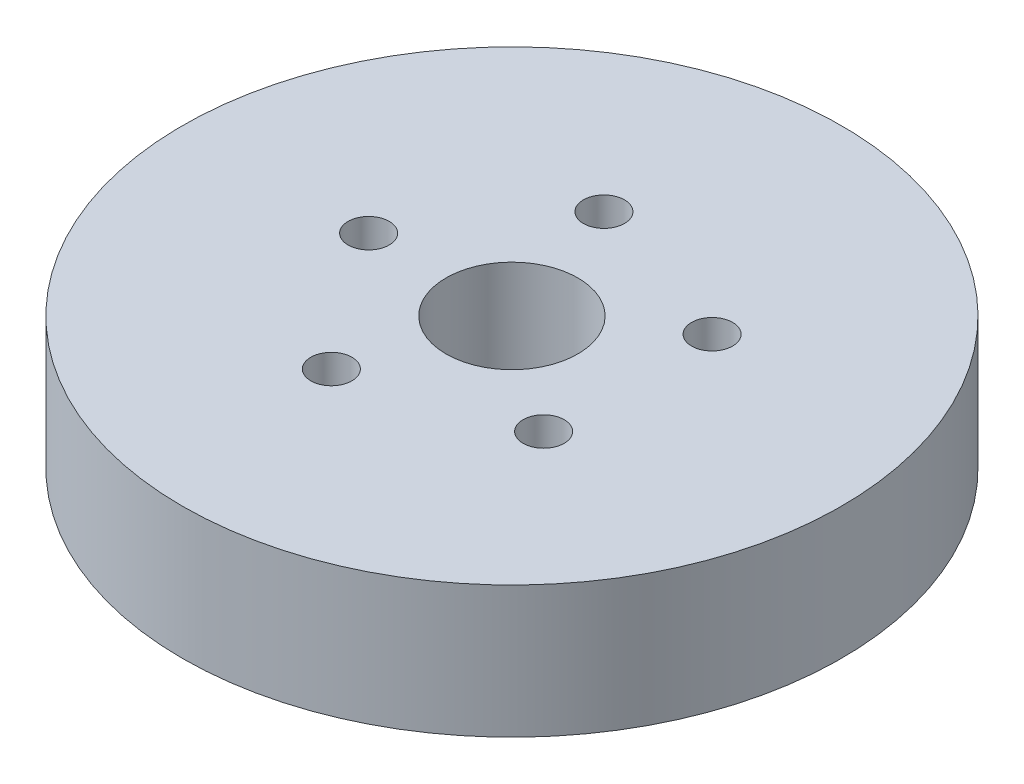
ISO-10303-21;
HEADER;
FILE_DESCRIPTION(('STEP AP214'),'2;1');
FILE_NAME('part.step','',(''),(''),'','','');
FILE_SCHEMA(('AUTOMOTIVE_DESIGN { 1 0 10303 214 1 1 1 1 }'));
ENDSEC;
DATA;
#1=APPLICATION_CONTEXT('core data for automotive mechanical design processes');
#2=APPLICATION_PROTOCOL_DEFINITION('international standard','automotive_design',2000,#1);
#3=PRODUCT_CONTEXT('',#1,'mechanical');
#4=PRODUCT('Part','Part','',(#3));
#5=PRODUCT_RELATED_PRODUCT_CATEGORY('part','',(#4));
#6=PRODUCT_DEFINITION_FORMATION('','',#4);
#7=PRODUCT_DEFINITION_CONTEXT('part definition',#1,'design');
#8=PRODUCT_DEFINITION('design','',#6,#7);
#9=PRODUCT_DEFINITION_SHAPE('','',#8);
#10=(LENGTH_UNIT() NAMED_UNIT(*) SI_UNIT(.MILLI.,.METRE.));
#11=(NAMED_UNIT(*) PLANE_ANGLE_UNIT() SI_UNIT($,.RADIAN.));
#12=(NAMED_UNIT(*) SI_UNIT($,.STERADIAN.) SOLID_ANGLE_UNIT());
#13=UNCERTAINTY_MEASURE_WITH_UNIT(LENGTH_MEASURE(1.E-05),#10,'distance_accuracy_value','');
#14=(GEOMETRIC_REPRESENTATION_CONTEXT(3) GLOBAL_UNCERTAINTY_ASSIGNED_CONTEXT((#13)) GLOBAL_UNIT_ASSIGNED_CONTEXT((#10,
#11,#12)) REPRESENTATION_CONTEXT('',''));
#15=CARTESIAN_POINT('',(0.,0.,0.));
#16=DIRECTION('',(0.,0.,1.));
#17=DIRECTION('',(1.,0.,0.));
#18=AXIS2_PLACEMENT_3D('',#15,#16,#17);
#19=CARTESIAN_POINT('',(0.,20.,0.));
#20=DIRECTION('',(0.,-1.,0.));
#21=DIRECTION('',(0.,0.,-1.));
#22=AXIS2_PLACEMENT_3D('',#19,#20,#21);
#23=CYLINDRICAL_SURFACE('',#22,50.);
#24=CARTESIAN_POINT('',(0.,20.,0.));
#25=DIRECTION('',(0.,1.,0.));
#26=DIRECTION('',(0.,0.,1.));
#27=AXIS2_PLACEMENT_3D('',#24,#25,#26);
#28=CIRCLE('',#27,50.);
#29=CARTESIAN_POINT('',(0.,20.,50.));
#30=VERTEX_POINT('',#29);
#31=EDGE_CURVE('E10',#30,#30,#28,.T.);
#32=ORIENTED_EDGE('',*,*,#31,.F.);
#33=EDGE_LOOP('',(#32));
#34=FACE_BOUND('',#33,.T.);
#35=CARTESIAN_POINT('',(0.,0.,0.));
#36=DIRECTION('',(0.,1.,0.));
#37=DIRECTION('',(0.,0.,1.));
#38=AXIS2_PLACEMENT_3D('',#35,#36,#37);
#39=CIRCLE('',#38,50.);
#40=CARTESIAN_POINT('',(0.,0.,50.));
#41=VERTEX_POINT('',#40);
#42=EDGE_CURVE('E37',#41,#41,#39,.T.);
#43=ORIENTED_EDGE('',*,*,#42,.T.);
#44=EDGE_LOOP('',(#43));
#45=FACE_BOUND('',#44,.T.);
#46=ADVANCED_FACE('F40',(#34,#45),#23,.T.);
#47=CARTESIAN_POINT('',(0.,20.,0.));
#48=DIRECTION('',(0.,1.,0.));
#49=DIRECTION('',(0.,0.,1.));
#50=AXIS2_PLACEMENT_3D('',#47,#48,#49);
#51=PLANE('',#50);
#52=CARTESIAN_POINT('',(-6.71827309945667,20.,20.6767185164454));
#53=DIRECTION('',(0.,1.,0.));
#54=DIRECTION('',(0.951056516295155,0.,0.309016994374945));
#55=AXIS2_PLACEMENT_3D('',#52,#53,#54);
#56=CIRCLE('',#55,3.11496146790513);
#57=CARTESIAN_POINT('',(-3.75576869739717,20.,21.6392945468512));
#58=VERTEX_POINT('',#57);
#59=EDGE_CURVE('E78',#58,#58,#56,.T.);
#60=ORIENTED_EDGE('',*,*,#59,.F.);
#61=EDGE_LOOP('',(#60));
#62=FACE_BOUND('',#61,.T.);
#63=CARTESIAN_POINT('',(17.5886673200819,20.,12.7789148189774));
#64=DIRECTION('',(0.,1.,0.));
#65=DIRECTION('',(0.587785252292469,0.,-0.809016994374951));
#66=AXIS2_PLACEMENT_3D('',#63,#64,#65);
#67=CIRCLE('',#66,3.11496146790513);
#68=CARTESIAN_POINT('',(19.4195957323758,20.,10.258858054619));
#69=VERTEX_POINT('',#68);
#70=EDGE_CURVE('E71',#69,#69,#67,.T.);
#71=ORIENTED_EDGE('',*,*,#70,.F.);
#72=EDGE_LOOP('',(#71));
#73=FACE_BOUND('',#72,.T.);
#74=CARTESIAN_POINT('',(17.5886673200817,20.,-12.7789148189777));
#75=DIRECTION('',(0.,1.,0.));
#76=DIRECTION('',(-0.58778525229248,0.,-0.809016994374942));
#77=AXIS2_PLACEMENT_3D('',#74,#75,#76);
#78=CIRCLE('',#77,3.11496146790513);
#79=CARTESIAN_POINT('',(15.7577389077877,20.,-15.298971583336));
#80=VERTEX_POINT('',#79);
#81=EDGE_CURVE('E70',#80,#80,#78,.T.);
#82=ORIENTED_EDGE('',*,*,#81,.F.);
#83=EDGE_LOOP('',(#82));
#84=FACE_BOUND('',#83,.T.);
#85=CARTESIAN_POINT('',(-6.71827309945696,20.,-20.6767185164453));
#86=DIRECTION('',(0.,1.,0.));
#87=DIRECTION('',(-0.95105651629515,0.,0.309016994374958));
#88=AXIS2_PLACEMENT_3D('',#85,#86,#87);
#89=CIRCLE('',#88,3.11496146790513);
#90=CARTESIAN_POINT('',(-9.68077750151645,20.,-19.7141424860394));
#91=VERTEX_POINT('',#90);
#92=EDGE_CURVE('E61',#91,#91,#89,.T.);
#93=ORIENTED_EDGE('',*,*,#92,.F.);
#94=EDGE_LOOP('',(#93));
#95=FACE_BOUND('',#94,.T.);
#96=CARTESIAN_POINT('',(-21.7407884412502,20.,0.));
#97=DIRECTION('',(0.,1.,0.));
#98=DIRECTION('',(0.,0.,1.));
#99=AXIS2_PLACEMENT_3D('',#96,#97,#98);
#100=CIRCLE('',#99,3.11496146790513);
#101=CARTESIAN_POINT('',(-21.7407884412502,20.,3.11496146790513));
#102=VERTEX_POINT('',#101);
#103=EDGE_CURVE('E54',#102,#102,#100,.T.);
#104=ORIENTED_EDGE('',*,*,#103,.F.);
#105=EDGE_LOOP('',(#104));
#106=FACE_BOUND('',#105,.T.);
#107=CARTESIAN_POINT('',(0.,20.,0.));
#108=DIRECTION('',(0.,1.,0.));
#109=DIRECTION('',(0.,0.,1.));
#110=AXIS2_PLACEMENT_3D('',#107,#108,#109);
#111=CIRCLE('',#110,10.);
#112=CARTESIAN_POINT('',(0.,20.,10.));
#113=VERTEX_POINT('',#112);
#114=EDGE_CURVE('E50',#113,#113,#111,.T.);
#115=ORIENTED_EDGE('',*,*,#114,.F.);
#116=EDGE_LOOP('',(#115));
#117=FACE_BOUND('',#116,.T.);
#118=ORIENTED_EDGE('',*,*,#31,.T.);
#119=EDGE_LOOP('',(#118));
#120=FACE_BOUND('',#119,.T.);
#121=ADVANCED_FACE('F94',(#62,#73,#84,#95,#106,#117,#120),#51,.T.);
#122=CARTESIAN_POINT('',(0.,0.,0.));
#123=DIRECTION('',(0.,1.,0.));
#124=DIRECTION('',(0.,0.,1.));
#125=AXIS2_PLACEMENT_3D('',#122,#123,#124);
#126=PLANE('',#125);
#127=CARTESIAN_POINT('',(0.,0.,0.));
#128=DIRECTION('',(0.,1.,0.));
#129=DIRECTION('',(0.,0.,1.));
#130=AXIS2_PLACEMENT_3D('',#127,#128,#129);
#131=CIRCLE('',#130,10.);
#132=CARTESIAN_POINT('',(0.,0.,10.));
#133=VERTEX_POINT('',#132);
#134=EDGE_CURVE('E47',#133,#133,#131,.T.);
#135=ORIENTED_EDGE('',*,*,#134,.T.);
#136=EDGE_LOOP('',(#135));
#137=FACE_BOUND('',#136,.T.);
#138=ORIENTED_EDGE('',*,*,#42,.F.);
#139=EDGE_LOOP('',(#138));
#140=FACE_BOUND('',#139,.T.);
#141=ADVANCED_FACE('F100',(#137,#140),#126,.F.);
#142=CARTESIAN_POINT('',(0.,20.,0.));
#143=DIRECTION('',(0.,-1.,0.));
#144=DIRECTION('',(0.,0.,-1.));
#145=AXIS2_PLACEMENT_3D('',#142,#143,#144);
#146=CYLINDRICAL_SURFACE('',#145,10.);
#147=ORIENTED_EDGE('',*,*,#114,.T.);
#148=EDGE_LOOP('',(#147));
#149=FACE_BOUND('',#148,.T.);
#150=ORIENTED_EDGE('',*,*,#134,.F.);
#151=EDGE_LOOP('',(#150));
#152=FACE_BOUND('',#151,.T.);
#153=ADVANCED_FACE('F108',(#149,#152),#146,.F.);
#154=CARTESIAN_POINT('',(-21.7407884412502,3.8421350062287,0.));
#155=DIRECTION('',(0.,1.,0.));
#156=DIRECTION('',(0.,0.,1.));
#157=AXIS2_PLACEMENT_3D('',#154,#155,#156);
#158=CYLINDRICAL_SURFACE('',#157,3.11496146790513);
#159=CARTESIAN_POINT('',(-21.7407884412502,3.8421350062287,0.));
#160=DIRECTION('',(0.,1.,0.));
#161=DIRECTION('',(0.,0.,1.));
#162=AXIS2_PLACEMENT_3D('',#159,#160,#161);
#163=CIRCLE('',#162,3.11496146790513);
#164=CARTESIAN_POINT('',(-21.7407884412502,3.8421350062287,3.11496146790513));
#165=VERTEX_POINT('',#164);
#166=EDGE_CURVE('E55',#165,#165,#163,.T.);
#167=ORIENTED_EDGE('',*,*,#166,.F.);
#168=EDGE_LOOP('',(#167));
#169=FACE_BOUND('',#168,.T.);
#170=ORIENTED_EDGE('',*,*,#103,.T.);
#171=EDGE_LOOP('',(#170));
#172=FACE_BOUND('',#171,.T.);
#173=ADVANCED_FACE('F115',(#169,#172),#158,.F.);
#174=CARTESIAN_POINT('',(-21.7407884412502,3.8421350062287,0.));
#175=DIRECTION('',(0.,1.,0.));
#176=DIRECTION('',(0.,0.,1.));
#177=AXIS2_PLACEMENT_3D('',#174,#175,#176);
#178=PLANE('',#177);
#179=ORIENTED_EDGE('',*,*,#166,.T.);
#180=EDGE_LOOP('',(#179));
#181=FACE_BOUND('',#180,.T.);
#182=ADVANCED_FACE('F142',(#181),#178,.T.);
#183=CARTESIAN_POINT('',(-6.71827309945696,3.8421350062287,-20.6767185164453));
#184=DIRECTION('',(0.,1.,0.));
#185=DIRECTION('',(0.,0.,1.));
#186=AXIS2_PLACEMENT_3D('',#183,#184,#185);
#187=CYLINDRICAL_SURFACE('',#186,3.11496146790513);
#188=CARTESIAN_POINT('',(-6.71827309945696,3.8421350062287,-20.6767185164453));
#189=DIRECTION('',(0.,1.,0.));
#190=DIRECTION('',(-0.95105651629515,0.,0.309016994374958));
#191=AXIS2_PLACEMENT_3D('',#188,#189,#190);
#192=CIRCLE('',#191,3.11496146790513);
#193=CARTESIAN_POINT('',(-9.68077750151645,3.8421350062287,-19.7141424860394));
#194=VERTEX_POINT('',#193);
#195=EDGE_CURVE('E63',#194,#194,#192,.T.);
#196=ORIENTED_EDGE('',*,*,#195,.F.);
#197=EDGE_LOOP('',(#196));
#198=FACE_BOUND('',#197,.T.);
#199=ORIENTED_EDGE('',*,*,#92,.T.);
#200=EDGE_LOOP('',(#199));
#201=FACE_BOUND('',#200,.T.);
#202=ADVANCED_FACE('F147',(#198,#201),#187,.F.);
#203=CARTESIAN_POINT('',(-6.71827309945696,3.8421350062287,-20.6767185164453));
#204=DIRECTION('',(0.,1.,0.));
#205=DIRECTION('',(-0.95105651629515,0.,0.309016994374958));
#206=AXIS2_PLACEMENT_3D('',#203,#204,#205);
#207=PLANE('',#206);
#208=ORIENTED_EDGE('',*,*,#195,.T.);
#209=EDGE_LOOP('',(#208));
#210=FACE_BOUND('',#209,.T.);
#211=ADVANCED_FACE('F163',(#210),#207,.T.);
#212=CARTESIAN_POINT('',(17.5886673200817,3.8421350062287,-12.7789148189777));
#213=DIRECTION('',(0.,1.,0.));
#214=DIRECTION('',(0.,0.,1.));
#215=AXIS2_PLACEMENT_3D('',#212,#213,#214);
#216=CYLINDRICAL_SURFACE('',#215,3.11496146790513);
#217=CARTESIAN_POINT('',(17.5886673200817,3.8421350062287,-12.7789148189777));
#218=DIRECTION('',(0.,1.,0.));
#219=DIRECTION('',(-0.58778525229248,0.,-0.809016994374942));
#220=AXIS2_PLACEMENT_3D('',#217,#218,#219);
#221=CIRCLE('',#220,3.11496146790513);
#222=CARTESIAN_POINT('',(15.7577389077877,3.8421350062287,-15.298971583336));
#223=VERTEX_POINT('',#222);
#224=EDGE_CURVE('E69',#223,#223,#221,.T.);
#225=ORIENTED_EDGE('',*,*,#224,.F.);
#226=EDGE_LOOP('',(#225));
#227=FACE_BOUND('',#226,.T.);
#228=ORIENTED_EDGE('',*,*,#81,.T.);
#229=EDGE_LOOP('',(#228));
#230=FACE_BOUND('',#229,.T.);
#231=ADVANCED_FACE('F172',(#227,#230),#216,.F.);
#232=CARTESIAN_POINT('',(17.5886673200817,3.8421350062287,-12.7789148189777));
#233=DIRECTION('',(0.,1.,0.));
#234=DIRECTION('',(-0.58778525229248,0.,-0.809016994374942));
#235=AXIS2_PLACEMENT_3D('',#232,#233,#234);
#236=PLANE('',#235);
#237=ORIENTED_EDGE('',*,*,#224,.T.);
#238=EDGE_LOOP('',(#237));
#239=FACE_BOUND('',#238,.T.);
#240=ADVANCED_FACE('F185',(#239),#236,.T.);
#241=CARTESIAN_POINT('',(17.5886673200819,3.8421350062287,12.7789148189774));
#242=DIRECTION('',(0.,1.,0.));
#243=DIRECTION('',(0.,0.,1.));
#244=AXIS2_PLACEMENT_3D('',#241,#242,#243);
#245=CYLINDRICAL_SURFACE('',#244,3.11496146790513);
#246=CARTESIAN_POINT('',(17.5886673200819,3.8421350062287,12.7789148189774));
#247=DIRECTION('',(0.,1.,0.));
#248=DIRECTION('',(0.587785252292469,0.,-0.809016994374951));
#249=AXIS2_PLACEMENT_3D('',#246,#247,#248);
#250=CIRCLE('',#249,3.11496146790513);
#251=CARTESIAN_POINT('',(19.4195957323758,3.8421350062287,10.258858054619));
#252=VERTEX_POINT('',#251);
#253=EDGE_CURVE('E76',#252,#252,#250,.T.);
#254=ORIENTED_EDGE('',*,*,#253,.F.);
#255=EDGE_LOOP('',(#254));
#256=FACE_BOUND('',#255,.T.);
#257=ORIENTED_EDGE('',*,*,#70,.T.);
#258=EDGE_LOOP('',(#257));
#259=FACE_BOUND('',#258,.T.);
#260=ADVANCED_FACE('F191',(#256,#259),#245,.F.);
#261=CARTESIAN_POINT('',(17.5886673200819,3.8421350062287,12.7789148189774));
#262=DIRECTION('',(0.,1.,0.));
#263=DIRECTION('',(0.587785252292469,0.,-0.809016994374951));
#264=AXIS2_PLACEMENT_3D('',#261,#262,#263);
#265=PLANE('',#264);
#266=ORIENTED_EDGE('',*,*,#253,.T.);
#267=EDGE_LOOP('',(#266));
#268=FACE_BOUND('',#267,.T.);
#269=ADVANCED_FACE('F89',(#268),#265,.T.);
#270=CARTESIAN_POINT('',(-6.71827309945667,3.8421350062287,20.6767185164454));
#271=DIRECTION('',(0.,1.,0.));
#272=DIRECTION('',(0.,0.,1.));
#273=AXIS2_PLACEMENT_3D('',#270,#271,#272);
#274=CYLINDRICAL_SURFACE('',#273,3.11496146790513);
#275=CARTESIAN_POINT('',(-6.71827309945667,3.8421350062287,20.6767185164454));
#276=DIRECTION('',(0.,1.,0.));
#277=DIRECTION('',(0.951056516295155,0.,0.309016994374945));
#278=AXIS2_PLACEMENT_3D('',#275,#276,#277);
#279=CIRCLE('',#278,3.11496146790513);
#280=CARTESIAN_POINT('',(-3.75576869739717,3.8421350062287,21.6392945468512));
#281=VERTEX_POINT('',#280);
#282=EDGE_CURVE('E59',#281,#281,#279,.T.);
#283=ORIENTED_EDGE('',*,*,#282,.F.);
#284=EDGE_LOOP('',(#283));
#285=FACE_BOUND('',#284,.T.);
#286=ORIENTED_EDGE('',*,*,#59,.T.);
#287=EDGE_LOOP('',(#286));
#288=FACE_BOUND('',#287,.T.);
#289=ADVANCED_FACE('F87',(#285,#288),#274,.F.);
#290=CARTESIAN_POINT('',(-6.71827309945667,3.8421350062287,20.6767185164454));
#291=DIRECTION('',(0.,1.,0.));
#292=DIRECTION('',(0.951056516295155,0.,0.309016994374945));
#293=AXIS2_PLACEMENT_3D('',#290,#291,#292);
#294=PLANE('',#293);
#295=ORIENTED_EDGE('',*,*,#282,.T.);
#296=EDGE_LOOP('',(#295));
#297=FACE_BOUND('',#296,.T.);
#298=ADVANCED_FACE('F84',(#297),#294,.T.);
#299=CLOSED_SHELL('',(#46,#121,#141,#153,#173,#182,#202,#211,#231,#240,#260,#269,#289,#298));
#300=MANIFOLD_SOLID_BREP('B2',#299);
#301=ADVANCED_BREP_SHAPE_REPRESENTATION('',(#18,#300),#14);
#302=SHAPE_DEFINITION_REPRESENTATION(#9,#301);
ENDSEC;
END-ISO-10303-21;
